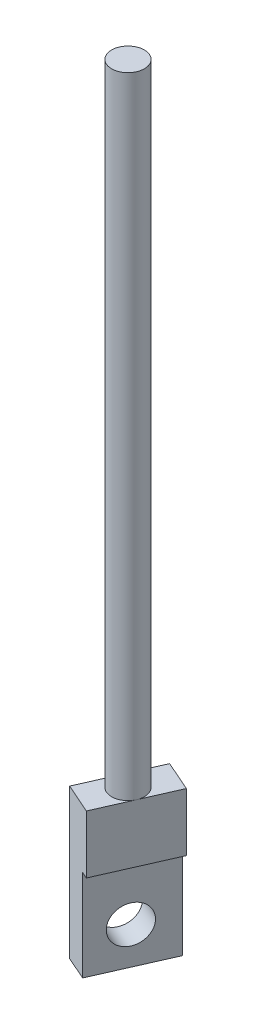
ISO-10303-21;
HEADER;
FILE_DESCRIPTION(('STEP AP214'),'2;1');
FILE_NAME('part.step','',(''),(''),'','','');
FILE_SCHEMA(('AUTOMOTIVE_DESIGN { 1 0 10303 214 1 1 1 1 }'));
ENDSEC;
DATA;
#1=APPLICATION_CONTEXT('core data for automotive mechanical design processes');
#2=APPLICATION_PROTOCOL_DEFINITION('international standard','automotive_design',2000,#1);
#3=PRODUCT_CONTEXT('',#1,'mechanical');
#4=PRODUCT('Part','Part','',(#3));
#5=PRODUCT_RELATED_PRODUCT_CATEGORY('part','',(#4));
#6=PRODUCT_DEFINITION_FORMATION('','',#4);
#7=PRODUCT_DEFINITION_CONTEXT('part definition',#1,'design');
#8=PRODUCT_DEFINITION('design','',#6,#7);
#9=PRODUCT_DEFINITION_SHAPE('','',#8);
#10=(LENGTH_UNIT() NAMED_UNIT(*) SI_UNIT(.MILLI.,.METRE.));
#11=(NAMED_UNIT(*) PLANE_ANGLE_UNIT() SI_UNIT($,.RADIAN.));
#12=(NAMED_UNIT(*) SI_UNIT($,.STERADIAN.) SOLID_ANGLE_UNIT());
#13=UNCERTAINTY_MEASURE_WITH_UNIT(LENGTH_MEASURE(1.E-05),#10,'distance_accuracy_value','');
#14=(GEOMETRIC_REPRESENTATION_CONTEXT(3) GLOBAL_UNCERTAINTY_ASSIGNED_CONTEXT((#13)) GLOBAL_UNIT_ASSIGNED_CONTEXT((#10,
#11,#12)) REPRESENTATION_CONTEXT('',''));
#15=CARTESIAN_POINT('',(0.,0.,0.));
#16=DIRECTION('',(0.,0.,1.));
#17=DIRECTION('',(1.,0.,0.));
#18=AXIS2_PLACEMENT_3D('',#15,#16,#17);
#19=CARTESIAN_POINT('',(-10.2954747340761,135.,-5.82655987697716));
#20=DIRECTION('',(0.,-1.,0.));
#21=DIRECTION('',(0.,0.,-1.));
#22=AXIS2_PLACEMENT_3D('',#19,#20,#21);
#23=CYLINDRICAL_SURFACE('',#22,3.5);
#24=CARTESIAN_POINT('',(-10.2954747340761,135.,-5.82655987697716));
#25=DIRECTION('',(0.,1.,0.));
#26=DIRECTION('',(0.,0.,1.));
#27=AXIS2_PLACEMENT_3D('',#24,#25,#26);
#28=CIRCLE('',#27,3.5);
#29=CARTESIAN_POINT('',(-10.2954747340761,135.,-2.32655987697716));
#30=VERTEX_POINT('',#29);
#31=EDGE_CURVE('E132',#30,#30,#28,.T.);
#32=ORIENTED_EDGE('',*,*,#31,.F.);
#33=EDGE_LOOP('',(#32));
#34=FACE_BOUND('',#33,.T.);
#35=CARTESIAN_POINT('',(-10.2954747340761,0.00933209694925496,-5.82655987697716));
#36=DIRECTION('',(0.000464015590766337,-0.999999338998674,-0.00105199417613112));
#37=DIRECTION('',(-0.403567509278817,-0.00114978355140785,0.9149491480144));
#38=AXIS2_PLACEMENT_3D('',#35,#36,#37);
#39=ELLIPSE('',#38,3.50000231350617,3.5);
#40=CARTESIAN_POINT('',(-13.4977988688674,0.00933209694923299,-7.23904709310921));
#41=VERTEX_POINT('',#40);
#42=CARTESIAN_POINT('',(-7.09315059928568,0.00933209694923288,-4.41407266084547));
#43=VERTEX_POINT('',#42);
#44=EDGE_CURVE('E11',#41,#43,#39,.T.);
#45=ORIENTED_EDGE('',*,*,#44,.F.);
#46=EDGE_CURVE('E41',#43,#41,#39,.T.);
#47=ORIENTED_EDGE('',*,*,#46,.F.);
#48=EDGE_LOOP('',(#45,#47));
#49=FACE_BOUND('',#48,.T.);
#50=ADVANCED_FACE('F33',(#34,#49),#23,.T.);
#51=CARTESIAN_POINT('',(-10.2954747340761,135.,-5.82655987697716));
#52=DIRECTION('',(0.,1.,0.));
#53=DIRECTION('',(0.,0.,1.));
#54=AXIS2_PLACEMENT_3D('',#51,#52,#53);
#55=PLANE('',#54);
#56=ORIENTED_EDGE('',*,*,#31,.T.);
#57=EDGE_LOOP('',(#56));
#58=FACE_BOUND('',#57,.T.);
#59=ADVANCED_FACE('F184',(#58),#55,.T.);
#60=CARTESIAN_POINT('',(-16.7733120013535,0.,0.187041184496006));
#61=DIRECTION('',(0.000464015590766337,-0.999999338998674,-0.00105199417613112));
#62=DIRECTION('',(0.,0.00105199428938382,-0.999999446653854));
#63=AXIS2_PLACEMENT_3D('',#60,#61,#62);
#64=PLANE('',#63);
#65=DIRECTION('',(0.403567509278842,0.00114978355140785,-0.914949148014389));
#66=VECTOR('',#65,1.);
#67=CARTESIAN_POINT('',(-16.7733120013535,0.,0.187041184496006));
#68=LINE('',#67,#66);
#69=CARTESIAN_POINT('',(-10.2208285274416,0.0186683455579432,-14.6684390858241));
#70=VERTEX_POINT('',#69);
#71=EDGE_CURVE('E113',#41,#70,#68,.T.);
#72=ORIENTED_EDGE('',*,*,#71,.F.);
#73=ORIENTED_EDGE('',*,*,#44,.T.);
#74=DIRECTION('',(0.403567509278842,0.00114978355140785,-0.914949148014389));
#75=VECTOR('',#74,1.);
#76=CARTESIAN_POINT('',(-10.3686637317718,0.,3.01201561675975));
#77=LINE('',#76,#75);
#78=CARTESIAN_POINT('',(-3.81618025785988,0.018668345557943,-11.8434646535603));
#79=VERTEX_POINT('',#78);
#80=EDGE_CURVE('E154',#43,#79,#77,.T.);
#81=ORIENTED_EDGE('',*,*,#80,.T.);
#82=DIRECTION('',(0.914949752797389,0.,0.403567776037677));
#83=VECTOR('',#82,1.);
#84=CARTESIAN_POINT('',(-10.2208285274416,0.0186683455579432,-14.6684390858241));
#85=LINE('',#84,#83);
#86=EDGE_CURVE('E129',#70,#79,#85,.T.);
#87=ORIENTED_EDGE('',*,*,#86,.F.);
#88=EDGE_LOOP('',(#72,#73,#81,#87));
#89=FACE_BOUND('',#88,.T.);
#90=ADVANCED_FACE('F141',(#89),#64,.F.);
#91=CARTESIAN_POINT('',(-10.3686637317718,0.,3.01201561675975));
#92=VERTEX_POINT('',#91);
#93=EDGE_CURVE('E112',#92,#43,#77,.T.);
#94=ORIENTED_EDGE('',*,*,#93,.T.);
#95=ORIENTED_EDGE('',*,*,#46,.T.);
#96=CARTESIAN_POINT('',(-16.7733120013535,0.,0.187041184496006));
#97=VERTEX_POINT('',#96);
#98=EDGE_CURVE('E116',#97,#41,#68,.T.);
#99=ORIENTED_EDGE('',*,*,#98,.F.);
#100=DIRECTION('',(0.914949752797389,0.,0.403567776037677));
#101=VECTOR('',#100,1.);
#102=CARTESIAN_POINT('',(-16.7733120013535,0.,0.187041184496006));
#103=LINE('',#102,#101);
#104=EDGE_CURVE('E121',#97,#92,#103,.T.);
#105=ORIENTED_EDGE('',*,*,#104,.T.);
#106=EDGE_LOOP('',(#94,#95,#99,#105));
#107=FACE_BOUND('',#106,.T.);
#108=ADVANCED_FACE('F137',(#107),#64,.F.);
#109=CARTESIAN_POINT('',(-10.2208285274416,0.0186683455579432,-14.6684390858241));
#110=DIRECTION('',(-0.403567776037677,0.,0.914949752797389));
#111=DIRECTION('',(0.914949752797389,0.,0.403567776037677));
#112=AXIS2_PLACEMENT_3D('',#109,#110,#111);
#113=PLANE('',#112);
#114=DIRECTION('',(-0.914949752797389,0.,-0.403567776037677));
#115=VECTOR('',#114,1.);
#116=CARTESIAN_POINT('',(-10.2208285274416,-12.4266165239039,-14.6684390858241));
#117=LINE('',#116,#115);
#118=CARTESIAN_POINT('',(-3.81618025785989,-12.4266165239039,-11.8434646535603));
#119=VERTEX_POINT('',#118);
#120=CARTESIAN_POINT('',(-5.24730869079553,-12.4266165239039,-12.4747095029505));
#121=VERTEX_POINT('',#120);
#122=EDGE_CURVE('E48',#119,#121,#117,.T.);
#123=ORIENTED_EDGE('',*,*,#122,.T.);
#124=DIRECTION('',(0.,-1.,0.));
#125=VECTOR('',#124,1.);
#126=CARTESIAN_POINT('',(-5.24730869079553,0.0186683455579433,-12.4747095029505));
#127=LINE('',#126,#125);
#128=CARTESIAN_POINT('',(-5.24730869079553,-32.,-12.4747095029505));
#129=VERTEX_POINT('',#128);
#130=EDGE_CURVE('E158',#121,#129,#127,.T.);
#131=ORIENTED_EDGE('',*,*,#130,.T.);
#132=DIRECTION('',(0.914949752797389,0.,0.403567776037677));
#133=VECTOR('',#132,1.);
#134=CARTESIAN_POINT('',(-10.2208285274416,-32.,-14.6684390858241));
#135=LINE('',#134,#133);
#136=CARTESIAN_POINT('',(-10.2208285274416,-32.,-14.6684390858241));
#137=VERTEX_POINT('',#136);
#138=EDGE_CURVE('E126',#137,#129,#135,.T.);
#139=ORIENTED_EDGE('',*,*,#138,.F.);
#140=DIRECTION('',(0.,-1.,0.));
#141=VECTOR('',#140,1.);
#142=CARTESIAN_POINT('',(-10.2208285274416,0.0186683455579432,-14.6684390858241));
#143=LINE('',#142,#141);
#144=EDGE_CURVE('E146',#70,#137,#143,.T.);
#145=ORIENTED_EDGE('',*,*,#144,.F.);
#146=ORIENTED_EDGE('',*,*,#86,.T.);
#147=DIRECTION('',(0.,-1.,0.));
#148=VECTOR('',#147,1.);
#149=CARTESIAN_POINT('',(-3.81618025785988,0.018668345557943,-11.8434646535603));
#150=LINE('',#149,#148);
#151=EDGE_CURVE('E114',#79,#119,#150,.T.);
#152=ORIENTED_EDGE('',*,*,#151,.T.);
#153=EDGE_LOOP('',(#123,#131,#139,#145,#146,#152));
#154=FACE_BOUND('',#153,.T.);
#155=ADVANCED_FACE('F174',(#154),#113,.F.);
#156=CARTESIAN_POINT('',(-10.2208285274416,-32.,-14.6684390858241));
#157=DIRECTION('',(0.,1.,0.));
#158=DIRECTION('',(-1.,0.,0.));
#159=AXIS2_PLACEMENT_3D('',#156,#157,#158);
#160=PLANE('',#159);
#161=ORIENTED_EDGE('',*,*,#138,.T.);
#162=DIRECTION('',(-0.403567776037677,0.,0.914949752797389));
#163=VECTOR('',#162,1.);
#164=CARTESIAN_POINT('',(-4.20420316222827,-32.,-14.8395889660102));
#165=LINE('',#164,#163);
#166=CARTESIAN_POINT('',(-11.7997921647074,-32.,2.38077076736962));
#167=VERTEX_POINT('',#166);
#168=EDGE_CURVE('E164',#129,#167,#165,.T.);
#169=ORIENTED_EDGE('',*,*,#168,.T.);
#170=DIRECTION('',(0.914949752797389,0.,0.403567776037677));
#171=VECTOR('',#170,1.);
#172=CARTESIAN_POINT('',(-16.7733120013535,-32.,0.187041184496007));
#173=LINE('',#172,#171);
#174=CARTESIAN_POINT('',(-16.7733120013535,-32.,0.187041184496007));
#175=VERTEX_POINT('',#174);
#176=EDGE_CURVE('E123',#175,#167,#173,.T.);
#177=ORIENTED_EDGE('',*,*,#176,.F.);
#178=DIRECTION('',(-0.403567776037677,0.,0.914949752797389));
#179=VECTOR('',#178,1.);
#180=CARTESIAN_POINT('',(-10.2208285274416,-32.,-14.6684390858241));
#181=LINE('',#180,#179);
#182=EDGE_CURVE('E147',#137,#175,#181,.T.);
#183=ORIENTED_EDGE('',*,*,#182,.F.);
#184=EDGE_LOOP('',(#161,#169,#177,#183));
#185=FACE_BOUND('',#184,.T.);
#186=ADVANCED_FACE('F171',(#185),#160,.F.);
#187=CARTESIAN_POINT('',(-16.7733120013535,-32.,0.187041184496007));
#188=DIRECTION('',(0.403567776037677,0.,-0.914949752797389));
#189=DIRECTION('',(-0.914949752797389,0.,-0.403567776037677));
#190=AXIS2_PLACEMENT_3D('',#187,#188,#189);
#191=PLANE('',#190);
#192=ORIENTED_EDGE('',*,*,#176,.T.);
#193=DIRECTION('',(0.,-1.,0.));
#194=VECTOR('',#193,1.);
#195=CARTESIAN_POINT('',(-11.7997921647074,-32.,2.38077076736962));
#196=LINE('',#195,#194);
#197=CARTESIAN_POINT('',(-11.7997921647074,-12.4266165239039,2.38077076736962));
#198=VERTEX_POINT('',#197);
#199=EDGE_CURVE('E99',#198,#167,#196,.T.);
#200=ORIENTED_EDGE('',*,*,#199,.F.);
#201=DIRECTION('',(-0.914949752797389,0.,-0.403567776037677));
#202=VECTOR('',#201,1.);
#203=CARTESIAN_POINT('',(-10.3686637317718,-12.4266165239039,3.01201561675974));
#204=LINE('',#203,#202);
#205=CARTESIAN_POINT('',(-10.3686637317718,-12.4266165239039,3.01201561675974));
#206=VERTEX_POINT('',#205);
#207=EDGE_CURVE('E92',#206,#198,#204,.T.);
#208=ORIENTED_EDGE('',*,*,#207,.F.);
#209=DIRECTION('',(0.,1.,0.));
#210=VECTOR('',#209,1.);
#211=CARTESIAN_POINT('',(-10.3686637317718,-32.,3.01201561675975));
#212=LINE('',#211,#210);
#213=EDGE_CURVE('E105',#206,#92,#212,.T.);
#214=ORIENTED_EDGE('',*,*,#213,.T.);
#215=ORIENTED_EDGE('',*,*,#104,.F.);
#216=DIRECTION('',(0.,1.,0.));
#217=VECTOR('',#216,1.);
#218=CARTESIAN_POINT('',(-16.7733120013535,-32.,0.187041184496007));
#219=LINE('',#218,#217);
#220=EDGE_CURVE('E124',#175,#97,#219,.T.);
#221=ORIENTED_EDGE('',*,*,#220,.F.);
#222=EDGE_LOOP('',(#192,#200,#208,#214,#215,#221));
#223=FACE_BOUND('',#222,.T.);
#224=ADVANCED_FACE('F103',(#223),#191,.F.);
#225=CARTESIAN_POINT('',(-13.9724299572677,0.,-6.16298596338923));
#226=DIRECTION('',(-0.914949752797389,0.,-0.403567776037677));
#227=DIRECTION('',(-0.403567776037677,0.,0.914949752797389));
#228=AXIS2_PLACEMENT_3D('',#225,#226,#227);
#229=PLANE('',#228);
#230=CARTESIAN_POINT('',(-13.6113940481991,-24.0704102881902,-6.98150948128896));
#231=DIRECTION('',(0.914949752797389,0.,0.403567776037677));
#232=DIRECTION('',(0.403567776037677,0.,-0.914949752797389));
#233=AXIS2_PLACEMENT_3D('',#230,#231,#232);
#234=CIRCLE('',#233,4.);
#235=CARTESIAN_POINT('',(-11.9971229440484,-24.0704102881902,-10.6413084924785));
#236=VERTEX_POINT('',#235);
#237=EDGE_CURVE('E150',#236,#236,#234,.T.);
#238=ORIENTED_EDGE('',*,*,#237,.T.);
#239=EDGE_LOOP('',(#238));
#240=FACE_BOUND('',#239,.T.);
#241=ORIENTED_EDGE('',*,*,#98,.T.);
#242=ORIENTED_EDGE('',*,*,#71,.T.);
#243=ORIENTED_EDGE('',*,*,#144,.T.);
#244=ORIENTED_EDGE('',*,*,#182,.T.);
#245=ORIENTED_EDGE('',*,*,#220,.T.);
#246=EDGE_LOOP('',(#241,#242,#243,#244,#245));
#247=FACE_BOUND('',#246,.T.);
#248=ADVANCED_FACE('F144',(#240,#247),#229,.T.);
#249=CARTESIAN_POINT('',(-7.56778168768601,0.,-3.33801153112549));
#250=DIRECTION('',(-0.914949752797389,0.,-0.403567776037677));
#251=DIRECTION('',(-0.403567776037677,0.,0.914949752797389));
#252=AXIS2_PLACEMENT_3D('',#249,#250,#251);
#253=PLANE('',#252);
#254=ORIENTED_EDGE('',*,*,#213,.F.);
#255=DIRECTION('',(-0.403567776037677,0.,0.914949752797389));
#256=VECTOR('',#255,1.);
#257=CARTESIAN_POINT('',(-2.77307472929262,-12.4266165239039,-14.2083441166201));
#258=LINE('',#257,#256);
#259=EDGE_CURVE('E89',#119,#206,#258,.T.);
#260=ORIENTED_EDGE('',*,*,#259,.F.);
#261=ORIENTED_EDGE('',*,*,#151,.F.);
#262=ORIENTED_EDGE('',*,*,#80,.F.);
#263=ORIENTED_EDGE('',*,*,#93,.F.);
#264=EDGE_LOOP('',(#254,#260,#261,#262,#263));
#265=FACE_BOUND('',#264,.T.);
#266=ADVANCED_FACE('F109',(#265),#253,.F.);
#267=CARTESIAN_POINT('',(-13.6113940481991,-24.0704102881902,-6.98150948128896));
#268=DIRECTION('',(0.914949752797389,0.,0.403567776037677));
#269=DIRECTION('',(0.403567776037677,0.,-0.914949752797389));
#270=AXIS2_PLACEMENT_3D('',#267,#268,#269);
#271=CYLINDRICAL_SURFACE('',#270,4.);
#272=CARTESIAN_POINT('',(-8.63787421155302,-24.0704102881902,-4.78777989841535));
#273=DIRECTION('',(-0.914949752797389,0.,-0.403567776037677));
#274=DIRECTION('',(-0.403567776037677,0.,0.914949752797389));
#275=AXIS2_PLACEMENT_3D('',#272,#273,#274);
#276=CIRCLE('',#275,4.);
#277=CARTESIAN_POINT('',(-10.2521453157037,-24.0704102881902,-1.12798088722579));
#278=VERTEX_POINT('',#277);
#279=EDGE_CURVE('E36',#278,#278,#276,.F.);
#280=ORIENTED_EDGE('',*,*,#279,.T.);
#281=EDGE_LOOP('',(#280));
#282=FACE_BOUND('',#281,.T.);
#283=ORIENTED_EDGE('',*,*,#237,.F.);
#284=EDGE_LOOP('',(#283));
#285=FACE_BOUND('',#284,.T.);
#286=ADVANCED_FACE('F235',(#282,#285),#271,.F.);
#287=CARTESIAN_POINT('',(-2.77307472929262,-12.4266165239039,-14.2083441166201));
#288=DIRECTION('',(0.,1.,0.));
#289=DIRECTION('',(0.,0.,1.));
#290=AXIS2_PLACEMENT_3D('',#287,#288,#289);
#291=PLANE('',#290);
#292=ORIENTED_EDGE('',*,*,#259,.T.);
#293=ORIENTED_EDGE('',*,*,#207,.T.);
#294=DIRECTION('',(-0.403567776037677,0.,0.914949752797389));
#295=VECTOR('',#294,1.);
#296=CARTESIAN_POINT('',(-4.20420316222827,-12.4266165239039,-14.8395889660102));
#297=LINE('',#296,#295);
#298=EDGE_CURVE('E98',#121,#198,#297,.T.);
#299=ORIENTED_EDGE('',*,*,#298,.F.);
#300=ORIENTED_EDGE('',*,*,#122,.F.);
#301=EDGE_LOOP('',(#292,#293,#299,#300));
#302=FACE_BOUND('',#301,.T.);
#303=ADVANCED_FACE('F91',(#302),#291,.F.);
#304=CARTESIAN_POINT('',(-4.20420316222827,-32.,-14.8395889660102));
#305=DIRECTION('',(-0.914949752797389,0.,-0.403567776037677));
#306=DIRECTION('',(-0.403567776037677,0.,0.914949752797389));
#307=AXIS2_PLACEMENT_3D('',#304,#305,#306);
#308=PLANE('',#307);
#309=ORIENTED_EDGE('',*,*,#279,.F.);
#310=EDGE_LOOP('',(#309));
#311=FACE_BOUND('',#310,.T.);
#312=ORIENTED_EDGE('',*,*,#298,.T.);
#313=ORIENTED_EDGE('',*,*,#199,.T.);
#314=ORIENTED_EDGE('',*,*,#168,.F.);
#315=ORIENTED_EDGE('',*,*,#130,.F.);
#316=EDGE_LOOP('',(#312,#313,#314,#315));
#317=FACE_BOUND('',#316,.T.);
#318=ADVANCED_FACE('F168',(#311,#317),#308,.F.);
#319=CLOSED_SHELL('',(#50,#59,#90,#108,#155,#186,#224,#248,#266,#286,#303,#318));
#320=MANIFOLD_SOLID_BREP('B2',#319);
#321=ADVANCED_BREP_SHAPE_REPRESENTATION('',(#18,#320),#14);
#322=SHAPE_DEFINITION_REPRESENTATION(#9,#321);
ENDSEC;
END-ISO-10303-21;
